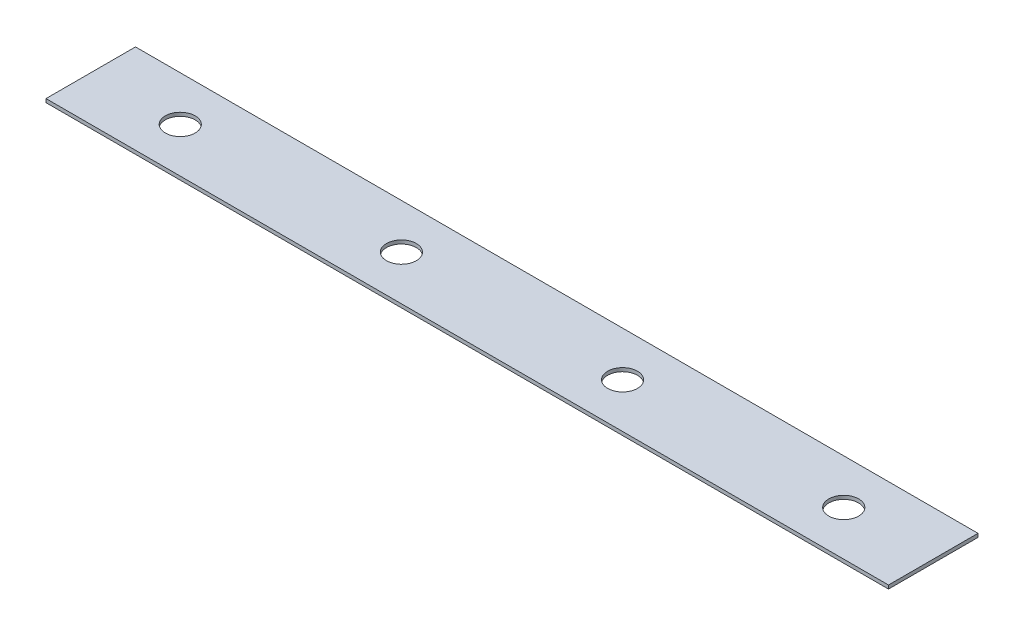
ISO-10303-21;
HEADER;
FILE_DESCRIPTION(('STEP AP214'),'2;1');
FILE_NAME('part.step','',(''),(''),'','','');
FILE_SCHEMA(('AUTOMOTIVE_DESIGN { 1 0 10303 214 1 1 1 1 }'));
ENDSEC;
DATA;
#1=APPLICATION_CONTEXT('core data for automotive mechanical design processes');
#2=APPLICATION_PROTOCOL_DEFINITION('international standard','automotive_design',2000,#1);
#3=PRODUCT_CONTEXT('',#1,'mechanical');
#4=PRODUCT('Part','Part','',(#3));
#5=PRODUCT_RELATED_PRODUCT_CATEGORY('part','',(#4));
#6=PRODUCT_DEFINITION_FORMATION('','',#4);
#7=PRODUCT_DEFINITION_CONTEXT('part definition',#1,'design');
#8=PRODUCT_DEFINITION('design','',#6,#7);
#9=PRODUCT_DEFINITION_SHAPE('','',#8);
#10=(LENGTH_UNIT() NAMED_UNIT(*) SI_UNIT(.MILLI.,.METRE.));
#11=(NAMED_UNIT(*) PLANE_ANGLE_UNIT() SI_UNIT($,.RADIAN.));
#12=(NAMED_UNIT(*) SI_UNIT($,.STERADIAN.) SOLID_ANGLE_UNIT());
#13=UNCERTAINTY_MEASURE_WITH_UNIT(LENGTH_MEASURE(1.E-05),#10,'distance_accuracy_value','');
#14=(GEOMETRIC_REPRESENTATION_CONTEXT(3) GLOBAL_UNCERTAINTY_ASSIGNED_CONTEXT((#13)) GLOBAL_UNIT_ASSIGNED_CONTEXT((#10,
#11,#12)) REPRESENTATION_CONTEXT('',''));
#15=CARTESIAN_POINT('',(0.,0.,0.));
#16=DIRECTION('',(0.,0.,1.));
#17=DIRECTION('',(1.,0.,0.));
#18=AXIS2_PLACEMENT_3D('',#15,#16,#17);
#19=CARTESIAN_POINT('',(358.63784,0.,0.));
#20=DIRECTION('',(0.,0.,-1.));
#21=DIRECTION('',(0.,1.,0.));
#22=AXIS2_PLACEMENT_3D('',#19,#20,#21);
#23=PLANE('',#22);
#24=DIRECTION('',(0.,-1.,0.));
#25=VECTOR('',#24,1.);
#26=CARTESIAN_POINT('',(0.,0.,0.));
#27=LINE('',#26,#25);
#28=CARTESIAN_POINT('',(0.,1.51892,0.));
#29=VERTEX_POINT('',#28);
#30=CARTESIAN_POINT('',(0.,0.,0.));
#31=VERTEX_POINT('',#30);
#32=EDGE_CURVE('E107',#29,#31,#27,.T.);
#33=ORIENTED_EDGE('',*,*,#32,.T.);
#34=DIRECTION('',(-1.,0.,0.));
#35=VECTOR('',#34,1.);
#36=CARTESIAN_POINT('',(358.63784,0.,0.));
#37=LINE('',#36,#35);
#38=CARTESIAN_POINT('',(358.63784,0.,0.));
#39=VERTEX_POINT('',#38);
#40=EDGE_CURVE('E11',#39,#31,#37,.T.);
#41=ORIENTED_EDGE('',*,*,#40,.F.);
#42=DIRECTION('',(0.,-1.,0.));
#43=VECTOR('',#42,1.);
#44=CARTESIAN_POINT('',(358.63784,0.,0.));
#45=LINE('',#44,#43);
#46=CARTESIAN_POINT('',(358.63784,1.51892,0.));
#47=VERTEX_POINT('',#46);
#48=EDGE_CURVE('E91',#47,#39,#45,.T.);
#49=ORIENTED_EDGE('',*,*,#48,.F.);
#50=DIRECTION('',(-1.,0.,0.));
#51=VECTOR('',#50,1.);
#52=CARTESIAN_POINT('',(358.63784,1.51892,0.));
#53=LINE('',#52,#51);
#54=EDGE_CURVE('E103',#47,#29,#53,.T.);
#55=ORIENTED_EDGE('',*,*,#54,.T.);
#56=EDGE_LOOP('',(#33,#41,#49,#55));
#57=FACE_BOUND('',#56,.T.);
#58=ADVANCED_FACE('F39',(#57),#23,.F.);
#59=CARTESIAN_POINT('',(358.63784,0.,0.));
#60=DIRECTION('',(0.,1.,0.));
#61=DIRECTION('',(0.,0.,1.));
#62=AXIS2_PLACEMENT_3D('',#59,#60,#61);
#63=PLANE('',#62);
#64=CARTESIAN_POINT('',(38.1,0.,-19.05));
#65=DIRECTION('',(0.,1.,0.));
#66=DIRECTION('',(0.,0.,1.));
#67=AXIS2_PLACEMENT_3D('',#64,#65,#66);
#68=CIRCLE('',#67,6.35);
#69=CARTESIAN_POINT('',(38.1,0.,-12.7));
#70=VERTEX_POINT('',#69);
#71=EDGE_CURVE('E111',#70,#70,#68,.T.);
#72=ORIENTED_EDGE('',*,*,#71,.T.);
#73=EDGE_LOOP('',(#72));
#74=FACE_BOUND('',#73,.T.);
#75=CARTESIAN_POINT('',(132.245946666667,0.,-19.05));
#76=DIRECTION('',(0.,1.,0.));
#77=DIRECTION('',(0.,0.,1.));
#78=AXIS2_PLACEMENT_3D('',#75,#76,#77);
#79=CIRCLE('',#78,6.35);
#80=CARTESIAN_POINT('',(132.245946666667,0.,-12.7));
#81=VERTEX_POINT('',#80);
#82=EDGE_CURVE('E148',#81,#81,#79,.T.);
#83=ORIENTED_EDGE('',*,*,#82,.T.);
#84=EDGE_LOOP('',(#83));
#85=FACE_BOUND('',#84,.T.);
#86=CARTESIAN_POINT('',(226.391893333333,0.,-19.05));
#87=DIRECTION('',(0.,1.,0.));
#88=DIRECTION('',(0.,0.,1.));
#89=AXIS2_PLACEMENT_3D('',#86,#87,#88);
#90=CIRCLE('',#89,6.35);
#91=CARTESIAN_POINT('',(226.391893333333,0.,-12.7));
#92=VERTEX_POINT('',#91);
#93=EDGE_CURVE('E140',#92,#92,#90,.T.);
#94=ORIENTED_EDGE('',*,*,#93,.T.);
#95=EDGE_LOOP('',(#94));
#96=FACE_BOUND('',#95,.T.);
#97=CARTESIAN_POINT('',(320.53784,0.,-19.05));
#98=DIRECTION('',(0.,1.,0.));
#99=DIRECTION('',(0.,0.,1.));
#100=AXIS2_PLACEMENT_3D('',#97,#98,#99);
#101=CIRCLE('',#100,6.35);
#102=CARTESIAN_POINT('',(320.53784,0.,-12.7));
#103=VERTEX_POINT('',#102);
#104=EDGE_CURVE('E132',#103,#103,#101,.T.);
#105=ORIENTED_EDGE('',*,*,#104,.T.);
#106=EDGE_LOOP('',(#105));
#107=FACE_BOUND('',#106,.T.);
#108=DIRECTION('',(0.,0.,-1.));
#109=VECTOR('',#108,1.);
#110=CARTESIAN_POINT('',(0.,0.,0.));
#111=LINE('',#110,#109);
#112=CARTESIAN_POINT('',(0.,0.,-38.1));
#113=VERTEX_POINT('',#112);
#114=EDGE_CURVE('E96',#31,#113,#111,.T.);
#115=ORIENTED_EDGE('',*,*,#114,.T.);
#116=DIRECTION('',(-1.,0.,0.));
#117=VECTOR('',#116,1.);
#118=CARTESIAN_POINT('',(358.63784,0.,-38.1));
#119=LINE('',#118,#117);
#120=CARTESIAN_POINT('',(358.63784,0.,-38.1));
#121=VERTEX_POINT('',#120);
#122=EDGE_CURVE('E48',#121,#113,#119,.T.);
#123=ORIENTED_EDGE('',*,*,#122,.F.);
#124=DIRECTION('',(0.,0.,-1.));
#125=VECTOR('',#124,1.);
#126=CARTESIAN_POINT('',(358.63784,0.,0.));
#127=LINE('',#126,#125);
#128=EDGE_CURVE('E86',#39,#121,#127,.T.);
#129=ORIENTED_EDGE('',*,*,#128,.F.);
#130=ORIENTED_EDGE('',*,*,#40,.T.);
#131=EDGE_LOOP('',(#115,#123,#129,#130));
#132=FACE_BOUND('',#131,.T.);
#133=ADVANCED_FACE('F95',(#74,#85,#96,#107,#132),#63,.F.);
#134=CARTESIAN_POINT('',(358.63784,0.,-38.1));
#135=DIRECTION('',(0.,0.,1.));
#136=DIRECTION('',(1.,0.,0.));
#137=AXIS2_PLACEMENT_3D('',#134,#135,#136);
#138=PLANE('',#137);
#139=DIRECTION('',(0.,1.,0.));
#140=VECTOR('',#139,1.);
#141=CARTESIAN_POINT('',(0.,0.,-38.1));
#142=LINE('',#141,#140);
#143=CARTESIAN_POINT('',(0.,1.51892,-38.1));
#144=VERTEX_POINT('',#143);
#145=EDGE_CURVE('E73',#113,#144,#142,.T.);
#146=ORIENTED_EDGE('',*,*,#145,.T.);
#147=DIRECTION('',(-1.,0.,0.));
#148=VECTOR('',#147,1.);
#149=CARTESIAN_POINT('',(358.63784,1.51892,-38.1));
#150=LINE('',#149,#148);
#151=CARTESIAN_POINT('',(358.63784,1.51892,-38.1));
#152=VERTEX_POINT('',#151);
#153=EDGE_CURVE('E98',#152,#144,#150,.T.);
#154=ORIENTED_EDGE('',*,*,#153,.F.);
#155=DIRECTION('',(0.,1.,0.));
#156=VECTOR('',#155,1.);
#157=CARTESIAN_POINT('',(358.63784,0.,-38.1));
#158=LINE('',#157,#156);
#159=EDGE_CURVE('E89',#121,#152,#158,.T.);
#160=ORIENTED_EDGE('',*,*,#159,.F.);
#161=ORIENTED_EDGE('',*,*,#122,.T.);
#162=EDGE_LOOP('',(#146,#154,#160,#161));
#163=FACE_BOUND('',#162,.T.);
#164=ADVANCED_FACE('F99',(#163),#138,.F.);
#165=CARTESIAN_POINT('',(358.63784,1.51892,0.));
#166=DIRECTION('',(0.,-1.,0.));
#167=DIRECTION('',(0.,0.,-1.));
#168=AXIS2_PLACEMENT_3D('',#165,#166,#167);
#169=PLANE('',#168);
#170=CARTESIAN_POINT('',(38.1,1.51892,-19.05));
#171=DIRECTION('',(0.,1.,0.));
#172=DIRECTION('',(0.,0.,1.));
#173=AXIS2_PLACEMENT_3D('',#170,#171,#172);
#174=CIRCLE('',#173,6.35);
#175=CARTESIAN_POINT('',(38.1,1.51892,-12.7));
#176=VERTEX_POINT('',#175);
#177=EDGE_CURVE('E152',#176,#176,#174,.T.);
#178=ORIENTED_EDGE('',*,*,#177,.F.);
#179=EDGE_LOOP('',(#178));
#180=FACE_BOUND('',#179,.T.);
#181=CARTESIAN_POINT('',(132.245946666667,1.51892,-19.05));
#182=DIRECTION('',(0.,1.,0.));
#183=DIRECTION('',(0.,0.,1.));
#184=AXIS2_PLACEMENT_3D('',#181,#182,#183);
#185=CIRCLE('',#184,6.35);
#186=CARTESIAN_POINT('',(132.245946666667,1.51892,-12.7));
#187=VERTEX_POINT('',#186);
#188=EDGE_CURVE('E144',#187,#187,#185,.T.);
#189=ORIENTED_EDGE('',*,*,#188,.F.);
#190=EDGE_LOOP('',(#189));
#191=FACE_BOUND('',#190,.T.);
#192=CARTESIAN_POINT('',(226.391893333333,1.51892,-19.05));
#193=DIRECTION('',(0.,1.,0.));
#194=DIRECTION('',(0.,0.,1.));
#195=AXIS2_PLACEMENT_3D('',#192,#193,#194);
#196=CIRCLE('',#195,6.35);
#197=CARTESIAN_POINT('',(226.391893333333,1.51892,-12.7));
#198=VERTEX_POINT('',#197);
#199=EDGE_CURVE('E136',#198,#198,#196,.T.);
#200=ORIENTED_EDGE('',*,*,#199,.F.);
#201=EDGE_LOOP('',(#200));
#202=FACE_BOUND('',#201,.T.);
#203=CARTESIAN_POINT('',(320.53784,1.51892,-19.05));
#204=DIRECTION('',(0.,1.,0.));
#205=DIRECTION('',(0.,0.,1.));
#206=AXIS2_PLACEMENT_3D('',#203,#204,#205);
#207=CIRCLE('',#206,6.35);
#208=CARTESIAN_POINT('',(320.53784,1.51892,-12.7));
#209=VERTEX_POINT('',#208);
#210=EDGE_CURVE('E128',#209,#209,#207,.T.);
#211=ORIENTED_EDGE('',*,*,#210,.F.);
#212=EDGE_LOOP('',(#211));
#213=FACE_BOUND('',#212,.T.);
#214=DIRECTION('',(0.,0.,1.));
#215=VECTOR('',#214,1.);
#216=CARTESIAN_POINT('',(0.,1.51892,0.));
#217=LINE('',#216,#215);
#218=EDGE_CURVE('E79',#144,#29,#217,.T.);
#219=ORIENTED_EDGE('',*,*,#218,.T.);
#220=ORIENTED_EDGE('',*,*,#54,.F.);
#221=DIRECTION('',(0.,0.,1.));
#222=VECTOR('',#221,1.);
#223=CARTESIAN_POINT('',(358.63784,1.51892,0.));
#224=LINE('',#223,#222);
#225=EDGE_CURVE('E56',#152,#47,#224,.T.);
#226=ORIENTED_EDGE('',*,*,#225,.F.);
#227=ORIENTED_EDGE('',*,*,#153,.T.);
#228=EDGE_LOOP('',(#219,#220,#226,#227));
#229=FACE_BOUND('',#228,.T.);
#230=ADVANCED_FACE('F121',(#180,#191,#202,#213,#229),#169,.F.);
#231=CARTESIAN_POINT('',(358.63784,0.,0.));
#232=DIRECTION('',(-1.,0.,0.));
#233=DIRECTION('',(0.,0.,1.));
#234=AXIS2_PLACEMENT_3D('',#231,#232,#233);
#235=PLANE('',#234);
#236=ORIENTED_EDGE('',*,*,#48,.T.);
#237=ORIENTED_EDGE('',*,*,#128,.T.);
#238=ORIENTED_EDGE('',*,*,#159,.T.);
#239=ORIENTED_EDGE('',*,*,#225,.T.);
#240=EDGE_LOOP('',(#236,#237,#238,#239));
#241=FACE_BOUND('',#240,.T.);
#242=ADVANCED_FACE('F87',(#241),#235,.F.);
#243=CARTESIAN_POINT('',(0.,0.,0.));
#244=DIRECTION('',(-1.,0.,0.));
#245=DIRECTION('',(0.,0.,1.));
#246=AXIS2_PLACEMENT_3D('',#243,#244,#245);
#247=PLANE('',#246);
#248=ORIENTED_EDGE('',*,*,#32,.F.);
#249=ORIENTED_EDGE('',*,*,#218,.F.);
#250=ORIENTED_EDGE('',*,*,#145,.F.);
#251=ORIENTED_EDGE('',*,*,#114,.F.);
#252=EDGE_LOOP('',(#248,#249,#250,#251));
#253=FACE_BOUND('',#252,.T.);
#254=ADVANCED_FACE('F124',(#253),#247,.T.);
#255=CARTESIAN_POINT('',(320.53784,0.,-19.05));
#256=DIRECTION('',(0.,1.,0.));
#257=DIRECTION('',(0.,0.,1.));
#258=AXIS2_PLACEMENT_3D('',#255,#256,#257);
#259=CYLINDRICAL_SURFACE('',#258,6.35);
#260=ORIENTED_EDGE('',*,*,#104,.F.);
#261=EDGE_LOOP('',(#260));
#262=FACE_BOUND('',#261,.T.);
#263=ORIENTED_EDGE('',*,*,#210,.T.);
#264=EDGE_LOOP('',(#263));
#265=FACE_BOUND('',#264,.T.);
#266=ADVANCED_FACE('F178',(#262,#265),#259,.F.);
#267=CARTESIAN_POINT('',(226.391893333333,0.,-19.05));
#268=DIRECTION('',(0.,1.,0.));
#269=DIRECTION('',(0.,0.,1.));
#270=AXIS2_PLACEMENT_3D('',#267,#268,#269);
#271=CYLINDRICAL_SURFACE('',#270,6.35);
#272=ORIENTED_EDGE('',*,*,#93,.F.);
#273=EDGE_LOOP('',(#272));
#274=FACE_BOUND('',#273,.T.);
#275=ORIENTED_EDGE('',*,*,#199,.T.);
#276=EDGE_LOOP('',(#275));
#277=FACE_BOUND('',#276,.T.);
#278=ADVANCED_FACE('F180',(#274,#277),#271,.F.);
#279=CARTESIAN_POINT('',(132.245946666667,0.,-19.05));
#280=DIRECTION('',(0.,1.,0.));
#281=DIRECTION('',(0.,0.,1.));
#282=AXIS2_PLACEMENT_3D('',#279,#280,#281);
#283=CYLINDRICAL_SURFACE('',#282,6.35);
#284=ORIENTED_EDGE('',*,*,#82,.F.);
#285=EDGE_LOOP('',(#284));
#286=FACE_BOUND('',#285,.T.);
#287=ORIENTED_EDGE('',*,*,#188,.T.);
#288=EDGE_LOOP('',(#287));
#289=FACE_BOUND('',#288,.T.);
#290=ADVANCED_FACE('F165',(#286,#289),#283,.F.);
#291=CARTESIAN_POINT('',(38.1,0.,-19.05));
#292=DIRECTION('',(0.,1.,0.));
#293=DIRECTION('',(0.,0.,1.));
#294=AXIS2_PLACEMENT_3D('',#291,#292,#293);
#295=CYLINDRICAL_SURFACE('',#294,6.35);
#296=ORIENTED_EDGE('',*,*,#71,.F.);
#297=EDGE_LOOP('',(#296));
#298=FACE_BOUND('',#297,.T.);
#299=ORIENTED_EDGE('',*,*,#177,.T.);
#300=EDGE_LOOP('',(#299));
#301=FACE_BOUND('',#300,.T.);
#302=ADVANCED_FACE('F162',(#298,#301),#295,.F.);
#303=CLOSED_SHELL('',(#58,#133,#164,#230,#242,#254,#266,#278,#290,#302));
#304=MANIFOLD_SOLID_BREP('B2',#303);
#305=ADVANCED_BREP_SHAPE_REPRESENTATION('',(#18,#304),#14);
#306=SHAPE_DEFINITION_REPRESENTATION(#9,#305);
ENDSEC;
END-ISO-10303-21;
